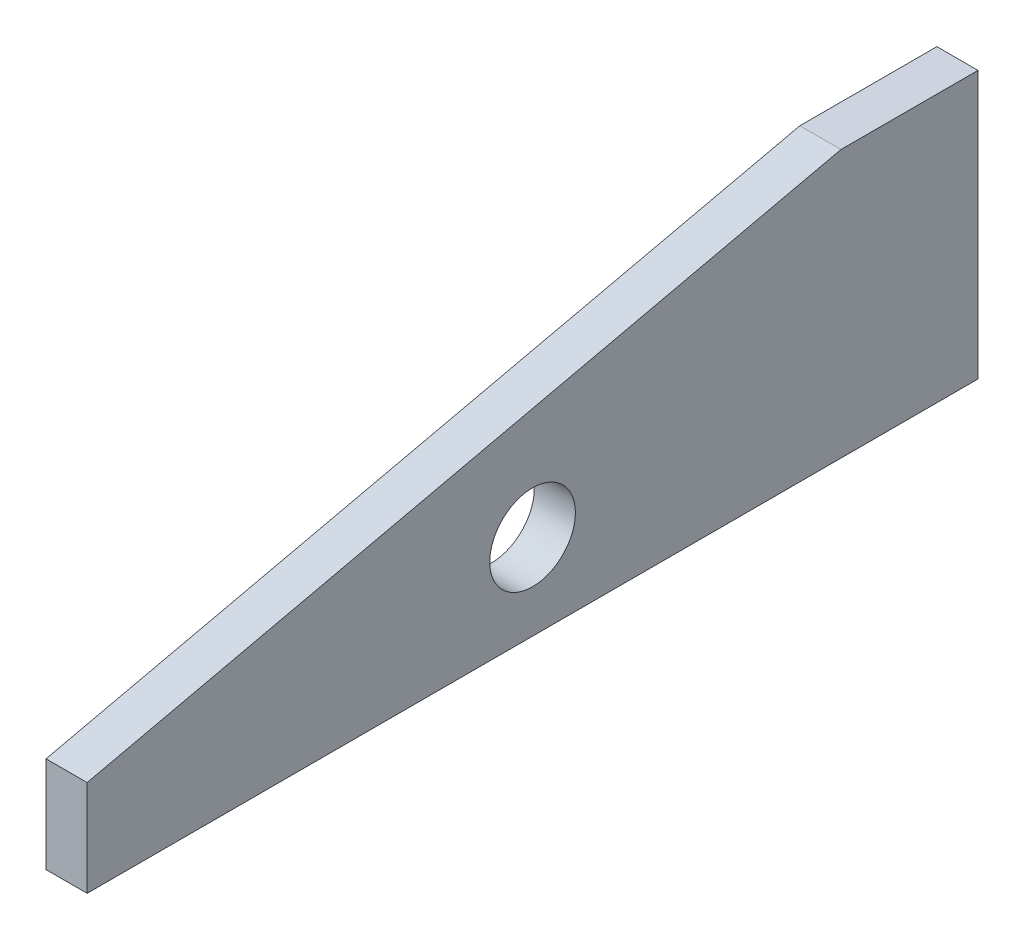
ISO-10303-21;
HEADER;
FILE_DESCRIPTION(('STEP AP214'),'2;1');
FILE_NAME('part.step','',(''),(''),'','','');
FILE_SCHEMA(('AUTOMOTIVE_DESIGN { 1 0 10303 214 1 1 1 1 }'));
ENDSEC;
DATA;
#1=APPLICATION_CONTEXT('core data for automotive mechanical design processes');
#2=APPLICATION_PROTOCOL_DEFINITION('international standard','automotive_design',2000,#1);
#3=PRODUCT_CONTEXT('',#1,'mechanical');
#4=PRODUCT('Part','Part','',(#3));
#5=PRODUCT_RELATED_PRODUCT_CATEGORY('part','',(#4));
#6=PRODUCT_DEFINITION_FORMATION('','',#4);
#7=PRODUCT_DEFINITION_CONTEXT('part definition',#1,'design');
#8=PRODUCT_DEFINITION('design','',#6,#7);
#9=PRODUCT_DEFINITION_SHAPE('','',#8);
#10=(LENGTH_UNIT() NAMED_UNIT(*) SI_UNIT(.MILLI.,.METRE.));
#11=(NAMED_UNIT(*) PLANE_ANGLE_UNIT() SI_UNIT($,.RADIAN.));
#12=(NAMED_UNIT(*) SI_UNIT($,.STERADIAN.) SOLID_ANGLE_UNIT());
#13=UNCERTAINTY_MEASURE_WITH_UNIT(LENGTH_MEASURE(1.E-05),#10,'distance_accuracy_value','');
#14=(GEOMETRIC_REPRESENTATION_CONTEXT(3) GLOBAL_UNCERTAINTY_ASSIGNED_CONTEXT((#13)) GLOBAL_UNIT_ASSIGNED_CONTEXT((#10,
#11,#12)) REPRESENTATION_CONTEXT('',''));
#15=CARTESIAN_POINT('',(0.,0.,0.));
#16=DIRECTION('',(0.,0.,1.));
#17=DIRECTION('',(1.,0.,0.));
#18=AXIS2_PLACEMENT_3D('',#15,#16,#17);
#19=CARTESIAN_POINT('',(0.,0.,-115.));
#20=DIRECTION('',(0.,0.,-1.));
#21=DIRECTION('',(-1.,0.,0.));
#22=AXIS2_PLACEMENT_3D('',#19,#20,#21);
#23=PLANE('',#22);
#24=CARTESIAN_POINT('',(0.,69.,-115.));
#25=DIRECTION('',(0.,0.,-1.));
#26=DIRECTION('',(-1.,0.,0.));
#27=AXIS2_PLACEMENT_3D('',#24,#25,#26);
#28=CIRCLE('',#27,2.25);
#29=CARTESIAN_POINT('',(-2.25,69.,-115.));
#30=VERTEX_POINT('',#29);
#31=EDGE_CURVE('E20',#30,#30,#28,.T.);
#32=ORIENTED_EDGE('',*,*,#31,.T.);
#33=EDGE_LOOP('',(#32));
#34=FACE_BOUND('',#33,.T.);
#35=ADVANCED_FACE('F17',(#34),#23,.T.);
#36=CARTESIAN_POINT('',(0.,15.,0.));
#37=DIRECTION('',(0.,-1.,0.));
#38=DIRECTION('',(0.,0.,-1.));
#39=AXIS2_PLACEMENT_3D('',#36,#37,#38);
#40=PLANE('',#39);
#41=CARTESIAN_POINT('',(0.,15.,70.));
#42=DIRECTION('',(0.,-1.,0.));
#43=DIRECTION('',(0.,0.,-1.));
#44=AXIS2_PLACEMENT_3D('',#41,#42,#43);
#45=CIRCLE('',#44,1.75);
#46=CARTESIAN_POINT('',(0.,15.,68.25));
#47=VERTEX_POINT('',#46);
#48=EDGE_CURVE('E124',#47,#47,#45,.T.);
#49=ORIENTED_EDGE('',*,*,#48,.T.);
#50=EDGE_LOOP('',(#49));
#51=FACE_BOUND('',#50,.T.);
#52=ADVANCED_FACE('F202',(#51),#40,.T.);
#53=CARTESIAN_POINT('',(0.,15.,0.));
#54=DIRECTION('',(0.,-1.,0.));
#55=DIRECTION('',(0.,0.,-1.));
#56=AXIS2_PLACEMENT_3D('',#53,#54,#55);
#57=PLANE('',#56);
#58=CARTESIAN_POINT('',(0.,15.,20.));
#59=DIRECTION('',(0.,-1.,0.));
#60=DIRECTION('',(0.,0.,-1.));
#61=AXIS2_PLACEMENT_3D('',#58,#59,#60);
#62=CIRCLE('',#61,1.75);
#63=CARTESIAN_POINT('',(0.,15.,18.25));
#64=VERTEX_POINT('',#63);
#65=EDGE_CURVE('E122',#64,#64,#62,.T.);
#66=ORIENTED_EDGE('',*,*,#65,.T.);
#67=EDGE_LOOP('',(#66));
#68=FACE_BOUND('',#67,.T.);
#69=ADVANCED_FACE('F199',(#68),#57,.T.);
#70=CARTESIAN_POINT('',(0.,15.,0.));
#71=DIRECTION('',(0.,-1.,0.));
#72=DIRECTION('',(0.,0.,-1.));
#73=AXIS2_PLACEMENT_3D('',#70,#71,#72);
#74=PLANE('',#73);
#75=CARTESIAN_POINT('',(0.,15.,-80.));
#76=DIRECTION('',(0.,-1.,0.));
#77=DIRECTION('',(0.,0.,-1.));
#78=AXIS2_PLACEMENT_3D('',#75,#76,#77);
#79=CIRCLE('',#78,1.75);
#80=CARTESIAN_POINT('',(0.,15.,-81.75));
#81=VERTEX_POINT('',#80);
#82=EDGE_CURVE('E119',#81,#81,#79,.T.);
#83=ORIENTED_EDGE('',*,*,#82,.T.);
#84=EDGE_LOOP('',(#83));
#85=FACE_BOUND('',#84,.T.);
#86=ADVANCED_FACE('F195',(#85),#74,.T.);
#87=CARTESIAN_POINT('',(0.,15.,0.));
#88=DIRECTION('',(0.,-1.,0.));
#89=DIRECTION('',(0.,0.,-1.));
#90=AXIS2_PLACEMENT_3D('',#87,#88,#89);
#91=PLANE('',#90);
#92=CARTESIAN_POINT('',(0.,15.,-30.));
#93=DIRECTION('',(0.,-1.,0.));
#94=DIRECTION('',(0.,0.,-1.));
#95=AXIS2_PLACEMENT_3D('',#92,#93,#94);
#96=CIRCLE('',#95,1.75);
#97=CARTESIAN_POINT('',(0.,15.,-31.75));
#98=VERTEX_POINT('',#97);
#99=EDGE_CURVE('E116',#98,#98,#96,.T.);
#100=ORIENTED_EDGE('',*,*,#99,.T.);
#101=EDGE_LOOP('',(#100));
#102=FACE_BOUND('',#101,.T.);
#103=ADVANCED_FACE('F136',(#102),#91,.T.);
#104=CARTESIAN_POINT('',(0.,69.,-130.));
#105=DIRECTION('',(0.,0.,-1.));
#106=DIRECTION('',(-1.,0.,0.));
#107=AXIS2_PLACEMENT_3D('',#104,#105,#106);
#108=CYLINDRICAL_SURFACE('',#107,2.25);
#109=ORIENTED_EDGE('',*,*,#31,.F.);
#110=EDGE_LOOP('',(#109));
#111=FACE_BOUND('',#110,.T.);
#112=CARTESIAN_POINT('',(0.,69.,-130.));
#113=DIRECTION('',(0.,0.,-1.));
#114=DIRECTION('',(-1.,0.,0.));
#115=AXIS2_PLACEMENT_3D('',#112,#113,#114);
#116=CIRCLE('',#115,2.25);
#117=CARTESIAN_POINT('',(-2.25,69.,-130.));
#118=VERTEX_POINT('',#117);
#119=EDGE_CURVE('E110',#118,#118,#116,.F.);
#120=ORIENTED_EDGE('',*,*,#119,.F.);
#121=EDGE_LOOP('',(#120));
#122=FACE_BOUND('',#121,.T.);
#123=ADVANCED_FACE('F132',(#111,#122),#108,.F.);
#124=CARTESIAN_POINT('',(0.,0.,70.));
#125=DIRECTION('',(0.,-1.,0.));
#126=DIRECTION('',(0.,0.,-1.));
#127=AXIS2_PLACEMENT_3D('',#124,#125,#126);
#128=CYLINDRICAL_SURFACE('',#127,1.75);
#129=ORIENTED_EDGE('',*,*,#48,.F.);
#130=EDGE_LOOP('',(#129));
#131=FACE_BOUND('',#130,.T.);
#132=CARTESIAN_POINT('',(0.,0.,70.));
#133=DIRECTION('',(0.,-1.,0.));
#134=DIRECTION('',(0.,0.,-1.));
#135=AXIS2_PLACEMENT_3D('',#132,#133,#134);
#136=CIRCLE('',#135,1.75);
#137=CARTESIAN_POINT('',(0.,0.,68.25));
#138=VERTEX_POINT('',#137);
#139=EDGE_CURVE('E106',#138,#138,#136,.T.);
#140=ORIENTED_EDGE('',*,*,#139,.T.);
#141=EDGE_LOOP('',(#140));
#142=FACE_BOUND('',#141,.T.);
#143=ADVANCED_FACE('F135',(#131,#142),#128,.F.);
#144=CARTESIAN_POINT('',(0.,0.,20.));
#145=DIRECTION('',(0.,-1.,0.));
#146=DIRECTION('',(0.,0.,-1.));
#147=AXIS2_PLACEMENT_3D('',#144,#145,#146);
#148=CYLINDRICAL_SURFACE('',#147,1.75);
#149=ORIENTED_EDGE('',*,*,#65,.F.);
#150=EDGE_LOOP('',(#149));
#151=FACE_BOUND('',#150,.T.);
#152=CARTESIAN_POINT('',(0.,0.,20.));
#153=DIRECTION('',(0.,-1.,0.));
#154=DIRECTION('',(0.,0.,-1.));
#155=AXIS2_PLACEMENT_3D('',#152,#153,#154);
#156=CIRCLE('',#155,1.75);
#157=CARTESIAN_POINT('',(0.,0.,18.25));
#158=VERTEX_POINT('',#157);
#159=EDGE_CURVE('E103',#158,#158,#156,.T.);
#160=ORIENTED_EDGE('',*,*,#159,.T.);
#161=EDGE_LOOP('',(#160));
#162=FACE_BOUND('',#161,.T.);
#163=ADVANCED_FACE('F185',(#151,#162),#148,.F.);
#164=CARTESIAN_POINT('',(0.,0.,-80.));
#165=DIRECTION('',(0.,-1.,0.));
#166=DIRECTION('',(0.,0.,-1.));
#167=AXIS2_PLACEMENT_3D('',#164,#165,#166);
#168=CYLINDRICAL_SURFACE('',#167,1.75);
#169=ORIENTED_EDGE('',*,*,#82,.F.);
#170=EDGE_LOOP('',(#169));
#171=FACE_BOUND('',#170,.T.);
#172=CARTESIAN_POINT('',(0.,0.,-80.));
#173=DIRECTION('',(0.,-1.,0.));
#174=DIRECTION('',(0.,0.,-1.));
#175=AXIS2_PLACEMENT_3D('',#172,#173,#174);
#176=CIRCLE('',#175,1.75);
#177=CARTESIAN_POINT('',(0.,0.,-81.75));
#178=VERTEX_POINT('',#177);
#179=EDGE_CURVE('E100',#178,#178,#176,.T.);
#180=ORIENTED_EDGE('',*,*,#179,.T.);
#181=EDGE_LOOP('',(#180));
#182=FACE_BOUND('',#181,.T.);
#183=ADVANCED_FACE('F181',(#171,#182),#168,.F.);
#184=CARTESIAN_POINT('',(0.,0.,-30.));
#185=DIRECTION('',(0.,-1.,0.));
#186=DIRECTION('',(0.,0.,-1.));
#187=AXIS2_PLACEMENT_3D('',#184,#185,#186);
#188=CYLINDRICAL_SURFACE('',#187,1.75);
#189=ORIENTED_EDGE('',*,*,#99,.F.);
#190=EDGE_LOOP('',(#189));
#191=FACE_BOUND('',#190,.T.);
#192=CARTESIAN_POINT('',(0.,0.,-30.));
#193=DIRECTION('',(0.,-1.,0.));
#194=DIRECTION('',(0.,0.,-1.));
#195=AXIS2_PLACEMENT_3D('',#192,#193,#194);
#196=CIRCLE('',#195,1.75);
#197=CARTESIAN_POINT('',(0.,0.,-31.75));
#198=VERTEX_POINT('',#197);
#199=EDGE_CURVE('E97',#198,#198,#196,.T.);
#200=ORIENTED_EDGE('',*,*,#199,.T.);
#201=EDGE_LOOP('',(#200));
#202=FACE_BOUND('',#201,.T.);
#203=ADVANCED_FACE('F174',(#191,#202),#188,.F.);
#204=CARTESIAN_POINT('',(6.,0.,130.));
#205=DIRECTION('',(1.,0.,0.));
#206=DIRECTION('',(0.,0.,-1.));
#207=AXIS2_PLACEMENT_3D('',#204,#205,#206);
#208=PLANE('',#207);
#209=DIRECTION('',(0.,0.,1.));
#210=VECTOR('',#209,1.);
#211=CARTESIAN_POINT('',(6.,0.,0.));
#212=LINE('',#211,#210);
#213=CARTESIAN_POINT('',(6.,0.,130.));
#214=VERTEX_POINT('',#213);
#215=CARTESIAN_POINT('',(6.,0.,-130.));
#216=VERTEX_POINT('',#215);
#217=EDGE_CURVE('E96',#214,#216,#212,.F.);
#218=ORIENTED_EDGE('',*,*,#217,.T.);
#219=DIRECTION('',(0.,1.,0.));
#220=VECTOR('',#219,1.);
#221=CARTESIAN_POINT('',(6.,0.,-130.));
#222=LINE('',#221,#220);
#223=CARTESIAN_POINT('',(6.,78.,-130.));
#224=VERTEX_POINT('',#223);
#225=EDGE_CURVE('E113',#224,#216,#222,.F.);
#226=ORIENTED_EDGE('',*,*,#225,.F.);
#227=DIRECTION('',(0.,0.,1.));
#228=VECTOR('',#227,1.);
#229=CARTESIAN_POINT('',(6.,78.,0.));
#230=LINE('',#229,#228);
#231=CARTESIAN_POINT('',(6.,78.,-90.0000000000002));
#232=VERTEX_POINT('',#231);
#233=EDGE_CURVE('E71',#232,#224,#230,.F.);
#234=ORIENTED_EDGE('',*,*,#233,.F.);
#235=DIRECTION('',(0.,0.22162110358899,-0.975132855791455));
#236=VECTOR('',#235,1.);
#237=CARTESIAN_POINT('',(6.,78.,-90.));
#238=LINE('',#237,#236);
#239=CARTESIAN_POINT('',(6.,27.9999999999979,130.));
#240=VERTEX_POINT('',#239);
#241=EDGE_CURVE('E61',#232,#240,#238,.F.);
#242=ORIENTED_EDGE('',*,*,#241,.T.);
#243=DIRECTION('',(0.,1.,0.));
#244=VECTOR('',#243,1.);
#245=CARTESIAN_POINT('',(6.,0.,130.));
#246=LINE('',#245,#244);
#247=EDGE_CURVE('E68',#214,#240,#246,.T.);
#248=ORIENTED_EDGE('',*,*,#247,.F.);
#249=EDGE_LOOP('',(#218,#226,#234,#242,#248));
#250=FACE_BOUND('',#249,.T.);
#251=CARTESIAN_POINT('',(6.,25.,0.));
#252=DIRECTION('',(1.,0.,0.));
#253=DIRECTION('',(0.,0.,-1.));
#254=AXIS2_PLACEMENT_3D('',#251,#252,#253);
#255=CIRCLE('',#254,12.5);
#256=CARTESIAN_POINT('',(6.,25.,-12.5));
#257=VERTEX_POINT('',#256);
#258=EDGE_CURVE('E81',#257,#257,#255,.F.);
#259=ORIENTED_EDGE('',*,*,#258,.T.);
#260=EDGE_LOOP('',(#259));
#261=FACE_BOUND('',#260,.T.);
#262=ADVANCED_FACE('F66',(#250,#261),#208,.T.);
#263=CARTESIAN_POINT('',(6.,25.,0.));
#264=DIRECTION('',(1.,0.,0.));
#265=DIRECTION('',(0.,0.,-1.));
#266=AXIS2_PLACEMENT_3D('',#263,#264,#265);
#267=CYLINDRICAL_SURFACE('',#266,12.5);
#268=ORIENTED_EDGE('',*,*,#258,.F.);
#269=EDGE_LOOP('',(#268));
#270=FACE_BOUND('',#269,.T.);
#271=CARTESIAN_POINT('',(-6.,25.,0.));
#272=DIRECTION('',(1.,0.,0.));
#273=DIRECTION('',(0.,0.,-1.));
#274=AXIS2_PLACEMENT_3D('',#271,#272,#273);
#275=CIRCLE('',#274,12.5);
#276=CARTESIAN_POINT('',(-6.,25.,-12.5));
#277=VERTEX_POINT('',#276);
#278=EDGE_CURVE('E92',#277,#277,#275,.T.);
#279=ORIENTED_EDGE('',*,*,#278,.F.);
#280=EDGE_LOOP('',(#279));
#281=FACE_BOUND('',#280,.T.);
#282=ADVANCED_FACE('F165',(#270,#281),#267,.F.);
#283=CARTESIAN_POINT('',(-6.,0.,130.));
#284=DIRECTION('',(0.,0.,1.));
#285=DIRECTION('',(1.,0.,0.));
#286=AXIS2_PLACEMENT_3D('',#283,#284,#285);
#287=PLANE('',#286);
#288=DIRECTION('',(0.,1.,0.));
#289=VECTOR('',#288,1.);
#290=CARTESIAN_POINT('',(-6.,0.,130.));
#291=LINE('',#290,#289);
#292=CARTESIAN_POINT('',(-6.,0.,130.));
#293=VERTEX_POINT('',#292);
#294=CARTESIAN_POINT('',(-6.,27.9999999999979,130.));
#295=VERTEX_POINT('',#294);
#296=EDGE_CURVE('E95',#293,#295,#291,.T.);
#297=ORIENTED_EDGE('',*,*,#296,.F.);
#298=DIRECTION('',(1.,0.,0.));
#299=VECTOR('',#298,1.);
#300=CARTESIAN_POINT('',(0.,0.,130.));
#301=LINE('',#300,#299);
#302=EDGE_CURVE('E79',#293,#214,#301,.T.);
#303=ORIENTED_EDGE('',*,*,#302,.T.);
#304=ORIENTED_EDGE('',*,*,#247,.T.);
#305=DIRECTION('',(1.,0.,0.));
#306=VECTOR('',#305,1.);
#307=CARTESIAN_POINT('',(-6.,27.9999999999951,129.999999999999));
#308=LINE('',#307,#306);
#309=EDGE_CURVE('E73',#240,#295,#308,.F.);
#310=ORIENTED_EDGE('',*,*,#309,.T.);
#311=EDGE_LOOP('',(#297,#303,#304,#310));
#312=FACE_BOUND('',#311,.T.);
#313=ADVANCED_FACE('F76',(#312),#287,.T.);
#314=CARTESIAN_POINT('',(-6.,78.,-90.));
#315=DIRECTION('',(0.,-0.975132855791455,-0.22162110358899));
#316=DIRECTION('',(0.,0.22162110358899,-0.975132855791455));
#317=AXIS2_PLACEMENT_3D('',#314,#315,#316);
#318=PLANE('',#317);
#319=ORIENTED_EDGE('',*,*,#309,.F.);
#320=ORIENTED_EDGE('',*,*,#241,.F.);
#321=DIRECTION('',(1.,0.,0.));
#322=VECTOR('',#321,1.);
#323=CARTESIAN_POINT('',(0.,78.,-90.0000000000002));
#324=LINE('',#323,#322);
#325=CARTESIAN_POINT('',(-6.,78.,-90.0000000000003));
#326=VERTEX_POINT('',#325);
#327=EDGE_CURVE('E87',#326,#232,#324,.T.);
#328=ORIENTED_EDGE('',*,*,#327,.F.);
#329=DIRECTION('',(0.,0.221621103588973,-0.975132855791458));
#330=VECTOR('',#329,1.);
#331=CARTESIAN_POINT('',(-6.,27.9999999999988,130.));
#332=LINE('',#331,#330);
#333=EDGE_CURVE('E85',#295,#326,#332,.T.);
#334=ORIENTED_EDGE('',*,*,#333,.F.);
#335=EDGE_LOOP('',(#319,#320,#328,#334));
#336=FACE_BOUND('',#335,.T.);
#337=ADVANCED_FACE('F83',(#336),#318,.F.);
#338=CARTESIAN_POINT('',(0.,78.,0.));
#339=DIRECTION('',(0.,1.,0.));
#340=DIRECTION('',(0.,0.,1.));
#341=AXIS2_PLACEMENT_3D('',#338,#339,#340);
#342=PLANE('',#341);
#343=ORIENTED_EDGE('',*,*,#233,.T.);
#344=DIRECTION('',(-1.,0.,0.));
#345=VECTOR('',#344,1.);
#346=CARTESIAN_POINT('',(6.,78.,-130.));
#347=LINE('',#346,#345);
#348=CARTESIAN_POINT('',(-6.,78.,-130.));
#349=VERTEX_POINT('',#348);
#350=EDGE_CURVE('E109',#349,#224,#347,.F.);
#351=ORIENTED_EDGE('',*,*,#350,.F.);
#352=DIRECTION('',(0.,0.,1.));
#353=VECTOR('',#352,1.);
#354=CARTESIAN_POINT('',(-6.,78.,-130.));
#355=LINE('',#354,#353);
#356=EDGE_CURVE('E337',#326,#349,#355,.F.);
#357=ORIENTED_EDGE('',*,*,#356,.F.);
#358=ORIENTED_EDGE('',*,*,#327,.T.);
#359=EDGE_LOOP('',(#343,#351,#357,#358));
#360=FACE_BOUND('',#359,.T.);
#361=ADVANCED_FACE('F143',(#360),#342,.T.);
#362=CARTESIAN_POINT('',(6.,0.,-130.));
#363=DIRECTION('',(0.,0.,-1.));
#364=DIRECTION('',(-1.,0.,0.));
#365=AXIS2_PLACEMENT_3D('',#362,#363,#364);
#366=PLANE('',#365);
#367=DIRECTION('',(0.,1.,0.));
#368=VECTOR('',#367,1.);
#369=CARTESIAN_POINT('',(-6.,0.,-130.));
#370=LINE('',#369,#368);
#371=CARTESIAN_POINT('',(-6.,0.,-130.));
#372=VERTEX_POINT('',#371);
#373=EDGE_CURVE('E26',#349,#372,#370,.F.);
#374=ORIENTED_EDGE('',*,*,#373,.F.);
#375=ORIENTED_EDGE('',*,*,#350,.T.);
#376=ORIENTED_EDGE('',*,*,#225,.T.);
#377=DIRECTION('',(1.,0.,0.));
#378=VECTOR('',#377,1.);
#379=CARTESIAN_POINT('',(0.,0.,-130.));
#380=LINE('',#379,#378);
#381=EDGE_CURVE('E35',#216,#372,#380,.F.);
#382=ORIENTED_EDGE('',*,*,#381,.T.);
#383=EDGE_LOOP('',(#374,#375,#376,#382));
#384=FACE_BOUND('',#383,.T.);
#385=ORIENTED_EDGE('',*,*,#119,.T.);
#386=EDGE_LOOP('',(#385));
#387=FACE_BOUND('',#386,.T.);
#388=ADVANCED_FACE('F140',(#384,#387),#366,.T.);
#389=CARTESIAN_POINT('',(0.,0.,0.));
#390=DIRECTION('',(0.,1.,0.));
#391=DIRECTION('',(0.,0.,1.));
#392=AXIS2_PLACEMENT_3D('',#389,#390,#391);
#393=PLANE('',#392);
#394=ORIENTED_EDGE('',*,*,#302,.F.);
#395=DIRECTION('',(0.,0.,1.));
#396=VECTOR('',#395,1.);
#397=CARTESIAN_POINT('',(-6.,0.,-130.));
#398=LINE('',#397,#396);
#399=EDGE_CURVE('E11',#372,#293,#398,.T.);
#400=ORIENTED_EDGE('',*,*,#399,.F.);
#401=ORIENTED_EDGE('',*,*,#381,.F.);
#402=ORIENTED_EDGE('',*,*,#217,.F.);
#403=EDGE_LOOP('',(#394,#400,#401,#402));
#404=FACE_BOUND('',#403,.T.);
#405=ORIENTED_EDGE('',*,*,#199,.F.);
#406=EDGE_LOOP('',(#405));
#407=FACE_BOUND('',#406,.T.);
#408=ORIENTED_EDGE('',*,*,#179,.F.);
#409=EDGE_LOOP('',(#408));
#410=FACE_BOUND('',#409,.T.);
#411=ORIENTED_EDGE('',*,*,#159,.F.);
#412=EDGE_LOOP('',(#411));
#413=FACE_BOUND('',#412,.T.);
#414=ORIENTED_EDGE('',*,*,#139,.F.);
#415=EDGE_LOOP('',(#414));
#416=FACE_BOUND('',#415,.T.);
#417=ADVANCED_FACE('F142',(#404,#407,#410,#413,#416),#393,.F.);
#418=CARTESIAN_POINT('',(-6.,0.,-130.));
#419=DIRECTION('',(-1.,0.,0.));
#420=DIRECTION('',(0.,0.,1.));
#421=AXIS2_PLACEMENT_3D('',#418,#419,#420);
#422=PLANE('',#421);
#423=ORIENTED_EDGE('',*,*,#373,.T.);
#424=ORIENTED_EDGE('',*,*,#399,.T.);
#425=ORIENTED_EDGE('',*,*,#296,.T.);
#426=ORIENTED_EDGE('',*,*,#333,.T.);
#427=ORIENTED_EDGE('',*,*,#356,.T.);
#428=EDGE_LOOP('',(#423,#424,#425,#426,#427));
#429=FACE_BOUND('',#428,.T.);
#430=ORIENTED_EDGE('',*,*,#278,.T.);
#431=EDGE_LOOP('',(#430));
#432=FACE_BOUND('',#431,.T.);
#433=ADVANCED_FACE('F150',(#429,#432),#422,.T.);
#434=CLOSED_SHELL('',(#35,#52,#69,#86,#103,#123,#143,#163,#183,#203,#262,#282,#313,#337,#361,
#388,#417,#433));
#435=MANIFOLD_SOLID_BREP('B1',#434);
#436=ADVANCED_BREP_SHAPE_REPRESENTATION('',(#18,#435),#14);
#437=SHAPE_DEFINITION_REPRESENTATION(#9,#436);
ENDSEC;
END-ISO-10303-21;
